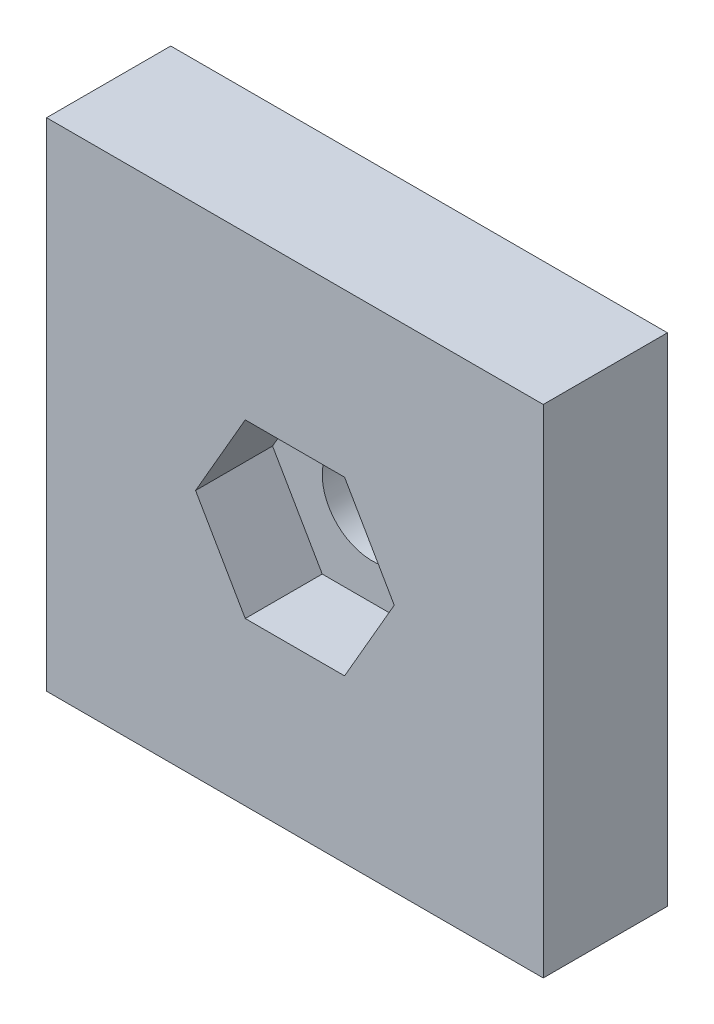
ISO-10303-21;
HEADER;
FILE_DESCRIPTION(('STEP AP214'),'2;1');
FILE_NAME('part.step','',(''),(''),'','','');
FILE_SCHEMA(('AUTOMOTIVE_DESIGN { 1 0 10303 214 1 1 1 1 }'));
ENDSEC;
DATA;
#1=APPLICATION_CONTEXT('core data for automotive mechanical design processes');
#2=APPLICATION_PROTOCOL_DEFINITION('international standard','automotive_design',2000,#1);
#3=PRODUCT_CONTEXT('',#1,'mechanical');
#4=PRODUCT('Part','Part','',(#3));
#5=PRODUCT_RELATED_PRODUCT_CATEGORY('part','',(#4));
#6=PRODUCT_DEFINITION_FORMATION('','',#4);
#7=PRODUCT_DEFINITION_CONTEXT('part definition',#1,'design');
#8=PRODUCT_DEFINITION('design','',#6,#7);
#9=PRODUCT_DEFINITION_SHAPE('','',#8);
#10=(LENGTH_UNIT() NAMED_UNIT(*) SI_UNIT(.MILLI.,.METRE.));
#11=(NAMED_UNIT(*) PLANE_ANGLE_UNIT() SI_UNIT($,.RADIAN.));
#12=(NAMED_UNIT(*) SI_UNIT($,.STERADIAN.) SOLID_ANGLE_UNIT());
#13=UNCERTAINTY_MEASURE_WITH_UNIT(LENGTH_MEASURE(1.E-05),#10,'distance_accuracy_value','');
#14=(GEOMETRIC_REPRESENTATION_CONTEXT(3) GLOBAL_UNCERTAINTY_ASSIGNED_CONTEXT((#13)) GLOBAL_UNIT_ASSIGNED_CONTEXT((#10,
#11,#12)) REPRESENTATION_CONTEXT('',''));
#15=CARTESIAN_POINT('',(0.,0.,0.));
#16=DIRECTION('',(0.,0.,1.));
#17=DIRECTION('',(1.,0.,0.));
#18=AXIS2_PLACEMENT_3D('',#15,#16,#17);
#19=CARTESIAN_POINT('',(0.,0.,5.));
#20=DIRECTION('',(-1.,0.,0.));
#21=DIRECTION('',(0.,0.,1.));
#22=AXIS2_PLACEMENT_3D('',#19,#20,#21);
#23=PLANE('',#22);
#24=DIRECTION('',(0.,1.,0.));
#25=VECTOR('',#24,1.);
#26=CARTESIAN_POINT('',(0.,0.,0.));
#27=LINE('',#26,#25);
#28=CARTESIAN_POINT('',(0.,0.,0.));
#29=VERTEX_POINT('',#28);
#30=CARTESIAN_POINT('',(0.,20.,0.));
#31=VERTEX_POINT('',#30);
#32=EDGE_CURVE('E189',#29,#31,#27,.T.);
#33=ORIENTED_EDGE('',*,*,#32,.T.);
#34=DIRECTION('',(0.,0.,-1.));
#35=VECTOR('',#34,1.);
#36=CARTESIAN_POINT('',(0.,20.,5.));
#37=LINE('',#36,#35);
#38=CARTESIAN_POINT('',(0.,20.,5.));
#39=VERTEX_POINT('',#38);
#40=EDGE_CURVE('E11',#39,#31,#37,.T.);
#41=ORIENTED_EDGE('',*,*,#40,.F.);
#42=DIRECTION('',(0.,1.,0.));
#43=VECTOR('',#42,1.);
#44=CARTESIAN_POINT('',(0.,0.,5.));
#45=LINE('',#44,#43);
#46=CARTESIAN_POINT('',(0.,0.,5.));
#47=VERTEX_POINT('',#46);
#48=EDGE_CURVE('E201',#47,#39,#45,.T.);
#49=ORIENTED_EDGE('',*,*,#48,.F.);
#50=DIRECTION('',(0.,0.,-1.));
#51=VECTOR('',#50,1.);
#52=CARTESIAN_POINT('',(0.,0.,5.));
#53=LINE('',#52,#51);
#54=EDGE_CURVE('E211',#47,#29,#53,.T.);
#55=ORIENTED_EDGE('',*,*,#54,.T.);
#56=EDGE_LOOP('',(#33,#41,#49,#55));
#57=FACE_BOUND('',#56,.T.);
#58=ADVANCED_FACE('F39',(#57),#23,.F.);
#59=CARTESIAN_POINT('',(0.,20.,5.));
#60=DIRECTION('',(0.,-1.,0.));
#61=DIRECTION('',(0.,0.,-1.));
#62=AXIS2_PLACEMENT_3D('',#59,#60,#61);
#63=PLANE('',#62);
#64=DIRECTION('',(-1.,0.,0.));
#65=VECTOR('',#64,1.);
#66=CARTESIAN_POINT('',(0.,20.,0.));
#67=LINE('',#66,#65);
#68=CARTESIAN_POINT('',(-20.,20.,0.));
#69=VERTEX_POINT('',#68);
#70=EDGE_CURVE('E215',#31,#69,#67,.T.);
#71=ORIENTED_EDGE('',*,*,#70,.T.);
#72=DIRECTION('',(0.,0.,-1.));
#73=VECTOR('',#72,1.);
#74=CARTESIAN_POINT('',(-20.,20.,5.));
#75=LINE('',#74,#73);
#76=CARTESIAN_POINT('',(-20.,20.,5.));
#77=VERTEX_POINT('',#76);
#78=EDGE_CURVE('E48',#77,#69,#75,.T.);
#79=ORIENTED_EDGE('',*,*,#78,.F.);
#80=DIRECTION('',(-1.,0.,0.));
#81=VECTOR('',#80,1.);
#82=CARTESIAN_POINT('',(0.,20.,5.));
#83=LINE('',#82,#81);
#84=EDGE_CURVE('E92',#39,#77,#83,.T.);
#85=ORIENTED_EDGE('',*,*,#84,.F.);
#86=ORIENTED_EDGE('',*,*,#40,.T.);
#87=EDGE_LOOP('',(#71,#79,#85,#86));
#88=FACE_BOUND('',#87,.T.);
#89=ADVANCED_FACE('F252',(#88),#63,.F.);
#90=CARTESIAN_POINT('',(-20.,0.,5.));
#91=DIRECTION('',(1.,0.,0.));
#92=DIRECTION('',(0.,0.,-1.));
#93=AXIS2_PLACEMENT_3D('',#90,#91,#92);
#94=PLANE('',#93);
#95=DIRECTION('',(0.,-1.,0.));
#96=VECTOR('',#95,1.);
#97=CARTESIAN_POINT('',(-20.,0.,0.));
#98=LINE('',#97,#96);
#99=CARTESIAN_POINT('',(-20.,0.,0.));
#100=VERTEX_POINT('',#99);
#101=EDGE_CURVE('E218',#69,#100,#98,.T.);
#102=ORIENTED_EDGE('',*,*,#101,.T.);
#103=DIRECTION('',(0.,0.,-1.));
#104=VECTOR('',#103,1.);
#105=CARTESIAN_POINT('',(-20.,0.,5.));
#106=LINE('',#105,#104);
#107=CARTESIAN_POINT('',(-20.,0.,5.));
#108=VERTEX_POINT('',#107);
#109=EDGE_CURVE('E225',#108,#100,#106,.T.);
#110=ORIENTED_EDGE('',*,*,#109,.F.);
#111=DIRECTION('',(0.,-1.,0.));
#112=VECTOR('',#111,1.);
#113=CARTESIAN_POINT('',(-20.,0.,5.));
#114=LINE('',#113,#112);
#115=EDGE_CURVE('E206',#77,#108,#114,.T.);
#116=ORIENTED_EDGE('',*,*,#115,.F.);
#117=ORIENTED_EDGE('',*,*,#78,.T.);
#118=EDGE_LOOP('',(#102,#110,#116,#117));
#119=FACE_BOUND('',#118,.T.);
#120=ADVANCED_FACE('F233',(#119),#94,.F.);
#121=CARTESIAN_POINT('',(0.,0.,5.));
#122=DIRECTION('',(0.,1.,0.));
#123=DIRECTION('',(0.,0.,1.));
#124=AXIS2_PLACEMENT_3D('',#121,#122,#123);
#125=PLANE('',#124);
#126=DIRECTION('',(1.,0.,0.));
#127=VECTOR('',#126,1.);
#128=CARTESIAN_POINT('',(0.,0.,0.));
#129=LINE('',#128,#127);
#130=EDGE_CURVE('E85',#100,#29,#129,.T.);
#131=ORIENTED_EDGE('',*,*,#130,.T.);
#132=ORIENTED_EDGE('',*,*,#54,.F.);
#133=DIRECTION('',(1.,0.,0.));
#134=VECTOR('',#133,1.);
#135=CARTESIAN_POINT('',(0.,0.,5.));
#136=LINE('',#135,#134);
#137=EDGE_CURVE('E64',#108,#47,#136,.T.);
#138=ORIENTED_EDGE('',*,*,#137,.F.);
#139=ORIENTED_EDGE('',*,*,#109,.T.);
#140=EDGE_LOOP('',(#131,#132,#138,#139));
#141=FACE_BOUND('',#140,.T.);
#142=ADVANCED_FACE('F241',(#141),#125,.F.);
#143=CARTESIAN_POINT('',(0.,0.,5.));
#144=DIRECTION('',(0.,0.,1.));
#145=DIRECTION('',(1.,0.,0.));
#146=AXIS2_PLACEMENT_3D('',#143,#144,#145);
#147=PLANE('',#146);
#148=DIRECTION('',(0.5,0.866025403784439,0.));
#149=VECTOR('',#148,1.);
#150=CARTESIAN_POINT('',(-8.,6.53589838486225,5.));
#151=LINE('',#150,#149);
#152=CARTESIAN_POINT('',(-8.,6.53589838486225,5.));
#153=VERTEX_POINT('',#152);
#154=CARTESIAN_POINT('',(-6.,10.,5.));
#155=VERTEX_POINT('',#154);
#156=EDGE_CURVE('E55',#153,#155,#151,.T.);
#157=ORIENTED_EDGE('',*,*,#156,.F.);
#158=DIRECTION('',(1.,0.,0.));
#159=VECTOR('',#158,1.);
#160=CARTESIAN_POINT('',(-12.,6.53589838486225,5.));
#161=LINE('',#160,#159);
#162=CARTESIAN_POINT('',(-12.,6.53589838486225,5.));
#163=VERTEX_POINT('',#162);
#164=EDGE_CURVE('E150',#163,#153,#161,.T.);
#165=ORIENTED_EDGE('',*,*,#164,.F.);
#166=DIRECTION('',(0.5,-0.866025403784439,0.));
#167=VECTOR('',#166,1.);
#168=CARTESIAN_POINT('',(-14.,10.,5.));
#169=LINE('',#168,#167);
#170=CARTESIAN_POINT('',(-14.,10.,5.));
#171=VERTEX_POINT('',#170);
#172=EDGE_CURVE('E154',#171,#163,#169,.T.);
#173=ORIENTED_EDGE('',*,*,#172,.F.);
#174=DIRECTION('',(-0.5,-0.866025403784439,0.));
#175=VECTOR('',#174,1.);
#176=CARTESIAN_POINT('',(-12.,13.4641016151378,5.));
#177=LINE('',#176,#175);
#178=CARTESIAN_POINT('',(-12.,13.4641016151378,5.));
#179=VERTEX_POINT('',#178);
#180=EDGE_CURVE('E179',#179,#171,#177,.T.);
#181=ORIENTED_EDGE('',*,*,#180,.F.);
#182=DIRECTION('',(-1.,0.,0.));
#183=VECTOR('',#182,1.);
#184=CARTESIAN_POINT('',(-8.,13.4641016151378,5.));
#185=LINE('',#184,#183);
#186=CARTESIAN_POINT('',(-8.,13.4641016151378,5.));
#187=VERTEX_POINT('',#186);
#188=EDGE_CURVE('E175',#187,#179,#185,.T.);
#189=ORIENTED_EDGE('',*,*,#188,.F.);
#190=DIRECTION('',(-0.5,0.866025403784439,0.));
#191=VECTOR('',#190,1.);
#192=CARTESIAN_POINT('',(-6.,10.,5.));
#193=LINE('',#192,#191);
#194=EDGE_CURVE('E172',#155,#187,#193,.T.);
#195=ORIENTED_EDGE('',*,*,#194,.F.);
#196=EDGE_LOOP('',(#157,#165,#173,#181,#189,#195));
#197=FACE_BOUND('',#196,.T.);
#198=ORIENTED_EDGE('',*,*,#48,.T.);
#199=ORIENTED_EDGE('',*,*,#84,.T.);
#200=ORIENTED_EDGE('',*,*,#115,.T.);
#201=ORIENTED_EDGE('',*,*,#137,.T.);
#202=EDGE_LOOP('',(#198,#199,#200,#201));
#203=FACE_BOUND('',#202,.T.);
#204=ADVANCED_FACE('F243',(#197,#203),#147,.T.);
#205=CARTESIAN_POINT('',(0.,0.,0.));
#206=DIRECTION('',(0.,0.,1.));
#207=DIRECTION('',(1.,0.,0.));
#208=AXIS2_PLACEMENT_3D('',#205,#206,#207);
#209=PLANE('',#208);
#210=CARTESIAN_POINT('',(-10.,10.,0.));
#211=DIRECTION('',(0.,0.,1.));
#212=DIRECTION('',(1.,0.,0.));
#213=AXIS2_PLACEMENT_3D('',#210,#211,#212);
#214=CIRCLE('',#213,2.);
#215=CARTESIAN_POINT('',(-8.,10.,0.));
#216=VERTEX_POINT('',#215);
#217=EDGE_CURVE('E157',#216,#216,#214,.T.);
#218=ORIENTED_EDGE('',*,*,#217,.T.);
#219=EDGE_LOOP('',(#218));
#220=FACE_BOUND('',#219,.T.);
#221=ORIENTED_EDGE('',*,*,#32,.F.);
#222=ORIENTED_EDGE('',*,*,#130,.F.);
#223=ORIENTED_EDGE('',*,*,#101,.F.);
#224=ORIENTED_EDGE('',*,*,#70,.F.);
#225=EDGE_LOOP('',(#221,#222,#223,#224));
#226=FACE_BOUND('',#225,.T.);
#227=ADVANCED_FACE('F237',(#220,#226),#209,.F.);
#228=CARTESIAN_POINT('',(-8.,6.53589838486225,1.9));
#229=DIRECTION('',(0.866025403784439,-0.5,0.));
#230=DIRECTION('',(0.5,0.866025403784439,0.));
#231=AXIS2_PLACEMENT_3D('',#228,#229,#230);
#232=PLANE('',#231);
#233=ORIENTED_EDGE('',*,*,#156,.T.);
#234=DIRECTION('',(0.,0.,1.));
#235=VECTOR('',#234,1.);
#236=CARTESIAN_POINT('',(-6.,10.,1.9));
#237=LINE('',#236,#235);
#238=CARTESIAN_POINT('',(-6.,10.,1.9));
#239=VERTEX_POINT('',#238);
#240=EDGE_CURVE('E124',#239,#155,#237,.T.);
#241=ORIENTED_EDGE('',*,*,#240,.F.);
#242=DIRECTION('',(0.5,0.866025403784439,0.));
#243=VECTOR('',#242,1.);
#244=CARTESIAN_POINT('',(-8.,6.53589838486225,1.9));
#245=LINE('',#244,#243);
#246=CARTESIAN_POINT('',(-8.,6.53589838486225,1.9));
#247=VERTEX_POINT('',#246);
#248=EDGE_CURVE('E128',#247,#239,#245,.T.);
#249=ORIENTED_EDGE('',*,*,#248,.F.);
#250=DIRECTION('',(0.,0.,1.));
#251=VECTOR('',#250,1.);
#252=CARTESIAN_POINT('',(-8.,6.53589838486225,1.9));
#253=LINE('',#252,#251);
#254=EDGE_CURVE('E186',#247,#153,#253,.T.);
#255=ORIENTED_EDGE('',*,*,#254,.T.);
#256=EDGE_LOOP('',(#233,#241,#249,#255));
#257=FACE_BOUND('',#256,.T.);
#258=ADVANCED_FACE('F126',(#257),#232,.F.);
#259=CARTESIAN_POINT('',(-12.,6.53589838486225,1.9));
#260=DIRECTION('',(0.,-1.,0.));
#261=DIRECTION('',(1.,0.,0.));
#262=AXIS2_PLACEMENT_3D('',#259,#260,#261);
#263=PLANE('',#262);
#264=ORIENTED_EDGE('',*,*,#164,.T.);
#265=ORIENTED_EDGE('',*,*,#254,.F.);
#266=DIRECTION('',(1.,0.,0.));
#267=VECTOR('',#266,1.);
#268=CARTESIAN_POINT('',(-12.,6.53589838486225,1.9));
#269=LINE('',#268,#267);
#270=CARTESIAN_POINT('',(-12.,6.53589838486225,1.9));
#271=VERTEX_POINT('',#270);
#272=EDGE_CURVE('E135',#271,#247,#269,.T.);
#273=ORIENTED_EDGE('',*,*,#272,.F.);
#274=DIRECTION('',(0.,0.,1.));
#275=VECTOR('',#274,1.);
#276=CARTESIAN_POINT('',(-12.,6.53589838486225,1.9));
#277=LINE('',#276,#275);
#278=EDGE_CURVE('E190',#271,#163,#277,.T.);
#279=ORIENTED_EDGE('',*,*,#278,.T.);
#280=EDGE_LOOP('',(#264,#265,#273,#279));
#281=FACE_BOUND('',#280,.T.);
#282=ADVANCED_FACE('F282',(#281),#263,.F.);
#283=CARTESIAN_POINT('',(-14.,10.,1.9));
#284=DIRECTION('',(-0.866025403784439,-0.5,0.));
#285=DIRECTION('',(0.5,-0.866025403784439,0.));
#286=AXIS2_PLACEMENT_3D('',#283,#284,#285);
#287=PLANE('',#286);
#288=ORIENTED_EDGE('',*,*,#172,.T.);
#289=ORIENTED_EDGE('',*,*,#278,.F.);
#290=DIRECTION('',(0.5,-0.866025403784439,0.));
#291=VECTOR('',#290,1.);
#292=CARTESIAN_POINT('',(-14.,10.,1.9));
#293=LINE('',#292,#291);
#294=CARTESIAN_POINT('',(-14.,10.,1.9));
#295=VERTEX_POINT('',#294);
#296=EDGE_CURVE('E165',#295,#271,#293,.T.);
#297=ORIENTED_EDGE('',*,*,#296,.F.);
#298=DIRECTION('',(0.,0.,1.));
#299=VECTOR('',#298,1.);
#300=CARTESIAN_POINT('',(-14.,10.,1.9));
#301=LINE('',#300,#299);
#302=EDGE_CURVE('E193',#295,#171,#301,.T.);
#303=ORIENTED_EDGE('',*,*,#302,.T.);
#304=EDGE_LOOP('',(#288,#289,#297,#303));
#305=FACE_BOUND('',#304,.T.);
#306=ADVANCED_FACE('F292',(#305),#287,.F.);
#307=CARTESIAN_POINT('',(-12.,13.4641016151378,1.9));
#308=DIRECTION('',(-0.866025403784439,0.5,0.));
#309=DIRECTION('',(-0.5,-0.866025403784439,0.));
#310=AXIS2_PLACEMENT_3D('',#307,#308,#309);
#311=PLANE('',#310);
#312=ORIENTED_EDGE('',*,*,#180,.T.);
#313=ORIENTED_EDGE('',*,*,#302,.F.);
#314=DIRECTION('',(-0.5,-0.866025403784439,0.));
#315=VECTOR('',#314,1.);
#316=CARTESIAN_POINT('',(-12.,13.4641016151378,1.9));
#317=LINE('',#316,#315);
#318=CARTESIAN_POINT('',(-12.,13.4641016151378,1.9));
#319=VERTEX_POINT('',#318);
#320=EDGE_CURVE('E161',#319,#295,#317,.T.);
#321=ORIENTED_EDGE('',*,*,#320,.F.);
#322=DIRECTION('',(0.,0.,1.));
#323=VECTOR('',#322,1.);
#324=CARTESIAN_POINT('',(-12.,13.4641016151378,1.9));
#325=LINE('',#324,#323);
#326=EDGE_CURVE('E196',#319,#179,#325,.T.);
#327=ORIENTED_EDGE('',*,*,#326,.T.);
#328=EDGE_LOOP('',(#312,#313,#321,#327));
#329=FACE_BOUND('',#328,.T.);
#330=ADVANCED_FACE('F302',(#329),#311,.F.);
#331=CARTESIAN_POINT('',(-8.,13.4641016151378,1.9));
#332=DIRECTION('',(0.,1.,0.));
#333=DIRECTION('',(0.,0.,1.));
#334=AXIS2_PLACEMENT_3D('',#331,#332,#333);
#335=PLANE('',#334);
#336=ORIENTED_EDGE('',*,*,#188,.T.);
#337=ORIENTED_EDGE('',*,*,#326,.F.);
#338=DIRECTION('',(-1.,0.,0.));
#339=VECTOR('',#338,1.);
#340=CARTESIAN_POINT('',(-8.,13.4641016151378,1.9));
#341=LINE('',#340,#339);
#342=CARTESIAN_POINT('',(-8.,13.4641016151378,1.9));
#343=VERTEX_POINT('',#342);
#344=EDGE_CURVE('E144',#343,#319,#341,.T.);
#345=ORIENTED_EDGE('',*,*,#344,.F.);
#346=DIRECTION('',(0.,0.,1.));
#347=VECTOR('',#346,1.);
#348=CARTESIAN_POINT('',(-8.,13.4641016151378,1.9));
#349=LINE('',#348,#347);
#350=EDGE_CURVE('E134',#343,#187,#349,.T.);
#351=ORIENTED_EDGE('',*,*,#350,.T.);
#352=EDGE_LOOP('',(#336,#337,#345,#351));
#353=FACE_BOUND('',#352,.T.);
#354=ADVANCED_FACE('F312',(#353),#335,.F.);
#355=CARTESIAN_POINT('',(-6.,10.,1.9));
#356=DIRECTION('',(0.866025403784439,0.5,0.));
#357=DIRECTION('',(-0.5,0.866025403784439,0.));
#358=AXIS2_PLACEMENT_3D('',#355,#356,#357);
#359=PLANE('',#358);
#360=ORIENTED_EDGE('',*,*,#194,.T.);
#361=ORIENTED_EDGE('',*,*,#350,.F.);
#362=DIRECTION('',(-0.5,0.866025403784439,0.));
#363=VECTOR('',#362,1.);
#364=CARTESIAN_POINT('',(-6.,10.,1.9));
#365=LINE('',#364,#363);
#366=EDGE_CURVE('E138',#239,#343,#365,.T.);
#367=ORIENTED_EDGE('',*,*,#366,.F.);
#368=ORIENTED_EDGE('',*,*,#240,.T.);
#369=EDGE_LOOP('',(#360,#361,#367,#368));
#370=FACE_BOUND('',#369,.T.);
#371=ADVANCED_FACE('F139',(#370),#359,.F.);
#372=CARTESIAN_POINT('',(0.,0.,1.9));
#373=DIRECTION('',(0.,0.,1.));
#374=DIRECTION('',(1.,0.,0.));
#375=AXIS2_PLACEMENT_3D('',#372,#373,#374);
#376=PLANE('',#375);
#377=CARTESIAN_POINT('',(-10.,10.,1.9));
#378=DIRECTION('',(0.,0.,1.));
#379=DIRECTION('',(1.,0.,0.));
#380=AXIS2_PLACEMENT_3D('',#377,#378,#379);
#381=CIRCLE('',#380,2.);
#382=CARTESIAN_POINT('',(-8.,10.,1.9));
#383=VERTEX_POINT('',#382);
#384=EDGE_CURVE('E42',#383,#383,#381,.T.);
#385=ORIENTED_EDGE('',*,*,#384,.F.);
#386=EDGE_LOOP('',(#385));
#387=FACE_BOUND('',#386,.T.);
#388=ORIENTED_EDGE('',*,*,#248,.T.);
#389=ORIENTED_EDGE('',*,*,#366,.T.);
#390=ORIENTED_EDGE('',*,*,#344,.T.);
#391=ORIENTED_EDGE('',*,*,#320,.T.);
#392=ORIENTED_EDGE('',*,*,#296,.T.);
#393=ORIENTED_EDGE('',*,*,#272,.T.);
#394=EDGE_LOOP('',(#388,#389,#390,#391,#392,#393));
#395=FACE_BOUND('',#394,.T.);
#396=ADVANCED_FACE('F146',(#387,#395),#376,.T.);
#397=CARTESIAN_POINT('',(-10.,10.,0.));
#398=DIRECTION('',(0.,0.,1.));
#399=DIRECTION('',(1.,0.,0.));
#400=AXIS2_PLACEMENT_3D('',#397,#398,#399);
#401=CYLINDRICAL_SURFACE('',#400,2.);
#402=ORIENTED_EDGE('',*,*,#384,.T.);
#403=EDGE_LOOP('',(#402));
#404=FACE_BOUND('',#403,.T.);
#405=ORIENTED_EDGE('',*,*,#217,.F.);
#406=EDGE_LOOP('',(#405));
#407=FACE_BOUND('',#406,.T.);
#408=ADVANCED_FACE('F343',(#404,#407),#401,.F.);
#409=CLOSED_SHELL('',(#58,#89,#120,#142,#204,#227,#258,#282,#306,#330,#354,#371,#396,#408));
#410=MANIFOLD_SOLID_BREP('B2',#409);
#411=ADVANCED_BREP_SHAPE_REPRESENTATION('',(#18,#410),#14);
#412=SHAPE_DEFINITION_REPRESENTATION(#9,#411);
ENDSEC;
END-ISO-10303-21;
